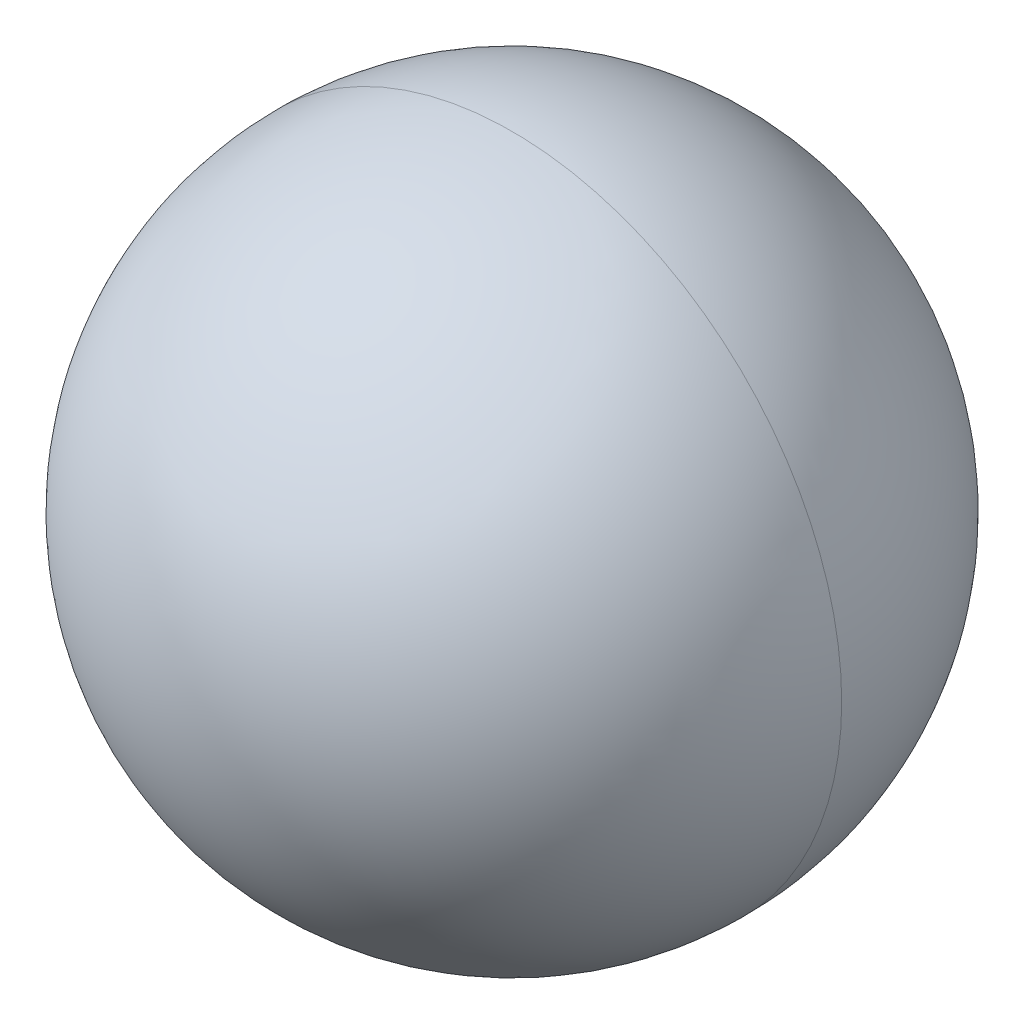
ISO-10303-21;
HEADER;
FILE_DESCRIPTION(('STEP AP214'),'2;1');
FILE_NAME('part.step','',(''),(''),'','','');
FILE_SCHEMA(('AUTOMOTIVE_DESIGN { 1 0 10303 214 1 1 1 1 }'));
ENDSEC;
DATA;
#1=APPLICATION_CONTEXT('core data for automotive mechanical design processes');
#2=APPLICATION_PROTOCOL_DEFINITION('international standard','automotive_design',2000,#1);
#3=PRODUCT_CONTEXT('',#1,'mechanical');
#4=PRODUCT('Part','Part','',(#3));
#5=PRODUCT_RELATED_PRODUCT_CATEGORY('part','',(#4));
#6=PRODUCT_DEFINITION_FORMATION('','',#4);
#7=PRODUCT_DEFINITION_CONTEXT('part definition',#1,'design');
#8=PRODUCT_DEFINITION('design','',#6,#7);
#9=PRODUCT_DEFINITION_SHAPE('','',#8);
#10=(LENGTH_UNIT() NAMED_UNIT(*) SI_UNIT(.MILLI.,.METRE.));
#11=(NAMED_UNIT(*) PLANE_ANGLE_UNIT() SI_UNIT($,.RADIAN.));
#12=(NAMED_UNIT(*) SI_UNIT($,.STERADIAN.) SOLID_ANGLE_UNIT());
#13=UNCERTAINTY_MEASURE_WITH_UNIT(LENGTH_MEASURE(1.E-05),#10,'distance_accuracy_value','');
#14=(GEOMETRIC_REPRESENTATION_CONTEXT(3) GLOBAL_UNCERTAINTY_ASSIGNED_CONTEXT((#13)) GLOBAL_UNIT_ASSIGNED_CONTEXT((#10,
#11,#12)) REPRESENTATION_CONTEXT('',''));
#15=CARTESIAN_POINT('',(0.,0.,0.));
#16=DIRECTION('',(0.,0.,1.));
#17=DIRECTION('',(1.,0.,0.));
#18=AXIS2_PLACEMENT_3D('',#15,#16,#17);
#19=CARTESIAN_POINT('',(6.,14.25,0.));
#20=DIRECTION('',(1.,0.,0.));
#21=DIRECTION('',(0.,0.,-1.));
#22=AXIS2_PLACEMENT_3D('',#19,#20,#21);
#23=SPHERICAL_SURFACE('',#22,3.572);
#24=CARTESIAN_POINT('',(6.,14.25,0.));
#25=DIRECTION('',(0.,0.,1.));
#26=DIRECTION('',(1.,0.,0.));
#27=AXIS2_PLACEMENT_3D('',#24,#25,#26);
#28=CIRCLE('',#27,3.572);
#29=CARTESIAN_POINT('',(9.572,14.25,0.));
#30=VERTEX_POINT('',#29);
#31=CARTESIAN_POINT('',(2.428,14.25,0.));
#32=VERTEX_POINT('',#31);
#33=EDGE_CURVE('E11',#30,#32,#28,.T.);
#34=ORIENTED_EDGE('',*,*,#33,.T.);
#35=CARTESIAN_POINT('',(6.,14.25,0.));
#36=DIRECTION('',(0.,0.,-1.));
#37=DIRECTION('',(1.,0.,0.));
#38=AXIS2_PLACEMENT_3D('',#35,#36,#37);
#39=CIRCLE('',#38,3.572);
#40=EDGE_CURVE('E25',#30,#32,#39,.T.);
#41=ORIENTED_EDGE('',*,*,#40,.F.);
#42=EDGE_LOOP('',(#34,#41));
#43=FACE_BOUND('',#42,.T.);
#44=ADVANCED_FACE('F16',(#43),#23,.T.);
#45=CARTESIAN_POINT('',(6.,14.25,0.));
#46=DIRECTION('',(1.,0.,0.));
#47=DIRECTION('',(0.,0.,1.));
#48=AXIS2_PLACEMENT_3D('',#45,#46,#47);
#49=SPHERICAL_SURFACE('',#48,3.572);
#50=ORIENTED_EDGE('',*,*,#33,.F.);
#51=ORIENTED_EDGE('',*,*,#40,.T.);
#52=EDGE_LOOP('',(#50,#51));
#53=FACE_BOUND('',#52,.T.);
#54=ADVANCED_FACE('F37',(#53),#49,.T.);
#55=CLOSED_SHELL('',(#44,#54));
#56=MANIFOLD_SOLID_BREP('B1',#55);
#57=ADVANCED_BREP_SHAPE_REPRESENTATION('',(#18,#56),#14);
#58=SHAPE_DEFINITION_REPRESENTATION(#9,#57);
ENDSEC;
END-ISO-10303-21;
